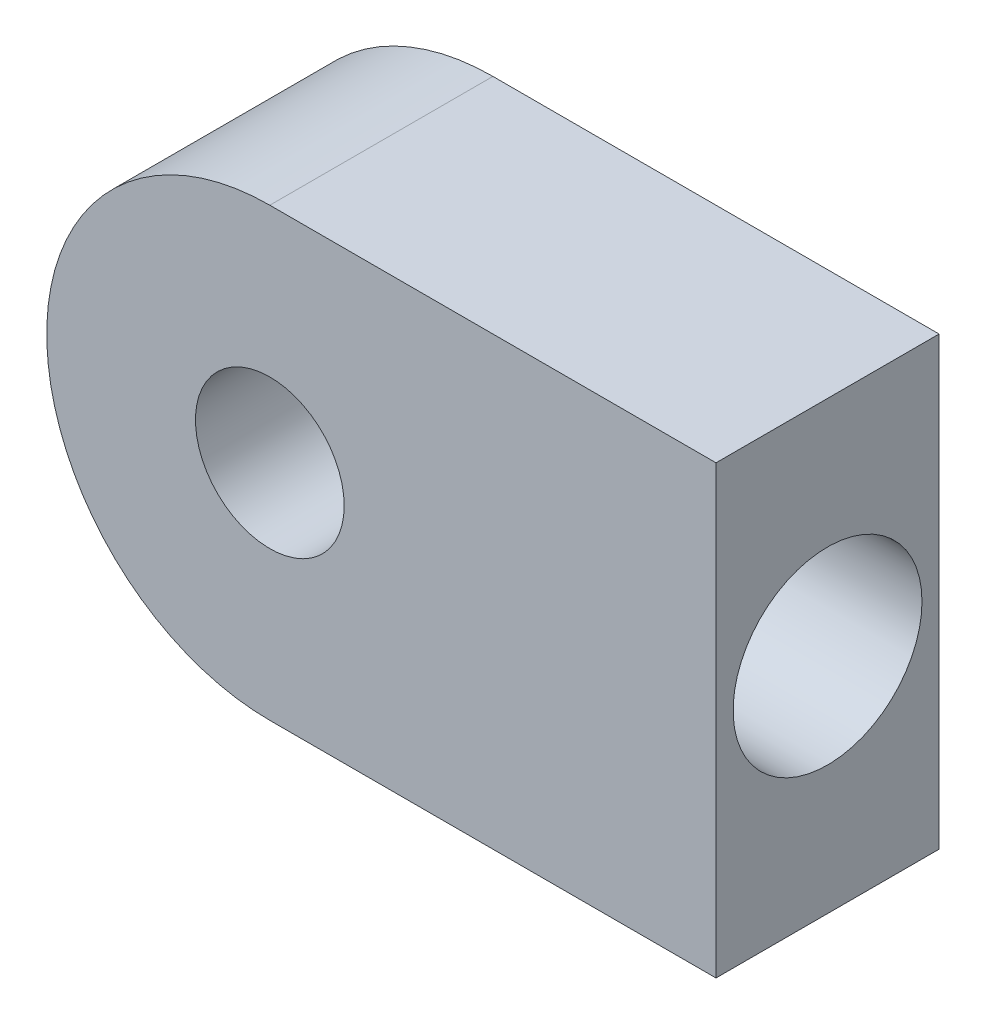
ISO-10303-21;
HEADER;
FILE_DESCRIPTION(('STEP AP214'),'2;1');
FILE_NAME('part.step','',(''),(''),'','','');
FILE_SCHEMA(('AUTOMOTIVE_DESIGN { 1 0 10303 214 1 1 1 1 }'));
ENDSEC;
DATA;
#1=APPLICATION_CONTEXT('core data for automotive mechanical design processes');
#2=APPLICATION_PROTOCOL_DEFINITION('international standard','automotive_design',2000,#1);
#3=PRODUCT_CONTEXT('',#1,'mechanical');
#4=PRODUCT('Part','Part','',(#3));
#5=PRODUCT_RELATED_PRODUCT_CATEGORY('part','',(#4));
#6=PRODUCT_DEFINITION_FORMATION('','',#4);
#7=PRODUCT_DEFINITION_CONTEXT('part definition',#1,'design');
#8=PRODUCT_DEFINITION('design','',#6,#7);
#9=PRODUCT_DEFINITION_SHAPE('','',#8);
#10=(LENGTH_UNIT() NAMED_UNIT(*) SI_UNIT(.MILLI.,.METRE.));
#11=(NAMED_UNIT(*) PLANE_ANGLE_UNIT() SI_UNIT($,.RADIAN.));
#12=(NAMED_UNIT(*) SI_UNIT($,.STERADIAN.) SOLID_ANGLE_UNIT());
#13=UNCERTAINTY_MEASURE_WITH_UNIT(LENGTH_MEASURE(1.E-05),#10,'distance_accuracy_value','');
#14=(GEOMETRIC_REPRESENTATION_CONTEXT(3) GLOBAL_UNCERTAINTY_ASSIGNED_CONTEXT((#13)) GLOBAL_UNIT_ASSIGNED_CONTEXT((#10,
#11,#12)) REPRESENTATION_CONTEXT('',''));
#15=CARTESIAN_POINT('',(0.,0.,0.));
#16=DIRECTION('',(0.,0.,1.));
#17=DIRECTION('',(1.,0.,0.));
#18=AXIS2_PLACEMENT_3D('',#15,#16,#17);
#19=CARTESIAN_POINT('',(0.,0.,7.5));
#20=DIRECTION('',(0.,0.,1.));
#21=DIRECTION('',(1.,0.,0.));
#22=AXIS2_PLACEMENT_3D('',#19,#20,#21);
#23=PLANE('',#22);
#24=CARTESIAN_POINT('',(0.,0.,7.5));
#25=DIRECTION('',(0.,0.,1.));
#26=DIRECTION('',(1.,0.,0.));
#27=AXIS2_PLACEMENT_3D('',#24,#25,#26);
#28=CIRCLE('',#27,15.);
#29=CARTESIAN_POINT('',(0.,15.,7.5));
#30=VERTEX_POINT('',#29);
#31=CARTESIAN_POINT('',(0.,-15.,7.5));
#32=VERTEX_POINT('',#31);
#33=EDGE_CURVE('E85',#30,#32,#28,.T.);
#34=ORIENTED_EDGE('',*,*,#33,.T.);
#35=DIRECTION('',(1.,0.,0.));
#36=VECTOR('',#35,1.);
#37=CARTESIAN_POINT('',(30.,-15.,7.5));
#38=LINE('',#37,#36);
#39=CARTESIAN_POINT('',(30.,-15.,7.5));
#40=VERTEX_POINT('',#39);
#41=EDGE_CURVE('E80',#32,#40,#38,.T.);
#42=ORIENTED_EDGE('',*,*,#41,.T.);
#43=DIRECTION('',(0.,1.,0.));
#44=VECTOR('',#43,1.);
#45=CARTESIAN_POINT('',(30.,15.,7.5));
#46=LINE('',#45,#44);
#47=CARTESIAN_POINT('',(30.,15.,7.5));
#48=VERTEX_POINT('',#47);
#49=EDGE_CURVE('E83',#40,#48,#46,.T.);
#50=ORIENTED_EDGE('',*,*,#49,.T.);
#51=DIRECTION('',(-1.,0.,0.));
#52=VECTOR('',#51,1.);
#53=CARTESIAN_POINT('',(0.,15.,7.5));
#54=LINE('',#53,#52);
#55=EDGE_CURVE('E50',#48,#30,#54,.T.);
#56=ORIENTED_EDGE('',*,*,#55,.T.);
#57=EDGE_LOOP('',(#34,#42,#50,#56));
#58=FACE_BOUND('',#57,.T.);
#59=CARTESIAN_POINT('',(0.,0.,7.5));
#60=DIRECTION('',(0.,0.,1.));
#61=DIRECTION('',(1.,0.,0.));
#62=AXIS2_PLACEMENT_3D('',#59,#60,#61);
#63=CIRCLE('',#62,5.);
#64=CARTESIAN_POINT('',(5.,0.,7.5));
#65=VERTEX_POINT('',#64);
#66=EDGE_CURVE('E100',#65,#65,#63,.T.);
#67=ORIENTED_EDGE('',*,*,#66,.F.);
#68=EDGE_LOOP('',(#67));
#69=FACE_BOUND('',#68,.T.);
#70=ADVANCED_FACE('F33',(#58,#69),#23,.T.);
#71=CARTESIAN_POINT('',(0.,0.,-7.5));
#72=DIRECTION('',(0.,0.,1.));
#73=DIRECTION('',(1.,0.,0.));
#74=AXIS2_PLACEMENT_3D('',#71,#72,#73);
#75=PLANE('',#74);
#76=CARTESIAN_POINT('',(0.,0.,-7.5));
#77=DIRECTION('',(0.,0.,1.));
#78=DIRECTION('',(1.,0.,0.));
#79=AXIS2_PLACEMENT_3D('',#76,#77,#78);
#80=CIRCLE('',#79,15.);
#81=CARTESIAN_POINT('',(0.,15.,-7.5));
#82=VERTEX_POINT('',#81);
#83=CARTESIAN_POINT('',(0.,-15.,-7.5));
#84=VERTEX_POINT('',#83);
#85=EDGE_CURVE('E97',#82,#84,#80,.T.);
#86=ORIENTED_EDGE('',*,*,#85,.F.);
#87=DIRECTION('',(-1.,0.,0.));
#88=VECTOR('',#87,1.);
#89=CARTESIAN_POINT('',(0.,15.,-7.5));
#90=LINE('',#89,#88);
#91=CARTESIAN_POINT('',(30.,15.,-7.5));
#92=VERTEX_POINT('',#91);
#93=EDGE_CURVE('E73',#92,#82,#90,.T.);
#94=ORIENTED_EDGE('',*,*,#93,.F.);
#95=DIRECTION('',(0.,1.,0.));
#96=VECTOR('',#95,1.);
#97=CARTESIAN_POINT('',(30.,15.,-7.5));
#98=LINE('',#97,#96);
#99=CARTESIAN_POINT('',(30.,-15.,-7.5));
#100=VERTEX_POINT('',#99);
#101=EDGE_CURVE('E67',#100,#92,#98,.T.);
#102=ORIENTED_EDGE('',*,*,#101,.F.);
#103=DIRECTION('',(1.,0.,0.));
#104=VECTOR('',#103,1.);
#105=CARTESIAN_POINT('',(30.,-15.,-7.5));
#106=LINE('',#105,#104);
#107=EDGE_CURVE('E89',#84,#100,#106,.T.);
#108=ORIENTED_EDGE('',*,*,#107,.F.);
#109=EDGE_LOOP('',(#86,#94,#102,#108));
#110=FACE_BOUND('',#109,.T.);
#111=CARTESIAN_POINT('',(0.,0.,-7.5));
#112=DIRECTION('',(0.,0.,1.));
#113=DIRECTION('',(1.,0.,0.));
#114=AXIS2_PLACEMENT_3D('',#111,#112,#113);
#115=CIRCLE('',#114,5.);
#116=CARTESIAN_POINT('',(5.,0.,-7.5));
#117=VERTEX_POINT('',#116);
#118=EDGE_CURVE('E112',#117,#117,#115,.T.);
#119=ORIENTED_EDGE('',*,*,#118,.T.);
#120=EDGE_LOOP('',(#119));
#121=FACE_BOUND('',#120,.T.);
#122=ADVANCED_FACE('F108',(#110,#121),#75,.F.);
#123=CARTESIAN_POINT('',(0.,0.,7.5));
#124=DIRECTION('',(0.,0.,-1.));
#125=DIRECTION('',(-1.,0.,0.));
#126=AXIS2_PLACEMENT_3D('',#123,#124,#125);
#127=CYLINDRICAL_SURFACE('',#126,15.);
#128=ORIENTED_EDGE('',*,*,#85,.T.);
#129=DIRECTION('',(0.,0.,-1.));
#130=VECTOR('',#129,1.);
#131=CARTESIAN_POINT('',(0.,-15.,7.5));
#132=LINE('',#131,#130);
#133=EDGE_CURVE('E11',#32,#84,#132,.T.);
#134=ORIENTED_EDGE('',*,*,#133,.F.);
#135=ORIENTED_EDGE('',*,*,#33,.F.);
#136=DIRECTION('',(0.,0.,-1.));
#137=VECTOR('',#136,1.);
#138=CARTESIAN_POINT('',(0.,15.,7.5));
#139=LINE('',#138,#137);
#140=EDGE_CURVE('E93',#30,#82,#139,.T.);
#141=ORIENTED_EDGE('',*,*,#140,.T.);
#142=EDGE_LOOP('',(#128,#134,#135,#141));
#143=FACE_BOUND('',#142,.T.);
#144=ADVANCED_FACE('F35',(#143),#127,.T.);
#145=CARTESIAN_POINT('',(30.,-15.,7.5));
#146=DIRECTION('',(0.,1.,0.));
#147=DIRECTION('',(0.,0.,1.));
#148=AXIS2_PLACEMENT_3D('',#145,#146,#147);
#149=PLANE('',#148);
#150=ORIENTED_EDGE('',*,*,#107,.T.);
#151=DIRECTION('',(0.,0.,-1.));
#152=VECTOR('',#151,1.);
#153=CARTESIAN_POINT('',(30.,-15.,7.5));
#154=LINE('',#153,#152);
#155=EDGE_CURVE('E42',#40,#100,#154,.T.);
#156=ORIENTED_EDGE('',*,*,#155,.F.);
#157=ORIENTED_EDGE('',*,*,#41,.F.);
#158=ORIENTED_EDGE('',*,*,#133,.T.);
#159=EDGE_LOOP('',(#150,#156,#157,#158));
#160=FACE_BOUND('',#159,.T.);
#161=ADVANCED_FACE('F88',(#160),#149,.F.);
#162=CARTESIAN_POINT('',(30.,15.,7.5));
#163=DIRECTION('',(-1.,0.,0.));
#164=DIRECTION('',(0.,0.,1.));
#165=AXIS2_PLACEMENT_3D('',#162,#163,#164);
#166=PLANE('',#165);
#167=CARTESIAN_POINT('',(30.,0.,0.));
#168=DIRECTION('',(1.,0.,0.));
#169=DIRECTION('',(0.,0.,-1.));
#170=AXIS2_PLACEMENT_3D('',#167,#168,#169);
#171=CIRCLE('',#170,6.35);
#172=CARTESIAN_POINT('',(30.,0.,-6.35));
#173=VERTEX_POINT('',#172);
#174=EDGE_CURVE('E118',#173,#173,#171,.T.);
#175=ORIENTED_EDGE('',*,*,#174,.F.);
#176=EDGE_LOOP('',(#175));
#177=FACE_BOUND('',#176,.T.);
#178=ORIENTED_EDGE('',*,*,#101,.T.);
#179=DIRECTION('',(0.,0.,-1.));
#180=VECTOR('',#179,1.);
#181=CARTESIAN_POINT('',(30.,15.,7.5));
#182=LINE('',#181,#180);
#183=EDGE_CURVE('E90',#48,#92,#182,.T.);
#184=ORIENTED_EDGE('',*,*,#183,.F.);
#185=ORIENTED_EDGE('',*,*,#49,.F.);
#186=ORIENTED_EDGE('',*,*,#155,.T.);
#187=EDGE_LOOP('',(#178,#184,#185,#186));
#188=FACE_BOUND('',#187,.T.);
#189=ADVANCED_FACE('F91',(#177,#188),#166,.F.);
#190=CARTESIAN_POINT('',(0.,15.,7.5));
#191=DIRECTION('',(0.,-1.,0.));
#192=DIRECTION('',(0.,0.,-1.));
#193=AXIS2_PLACEMENT_3D('',#190,#191,#192);
#194=PLANE('',#193);
#195=ORIENTED_EDGE('',*,*,#93,.T.);
#196=ORIENTED_EDGE('',*,*,#140,.F.);
#197=ORIENTED_EDGE('',*,*,#55,.F.);
#198=ORIENTED_EDGE('',*,*,#183,.T.);
#199=EDGE_LOOP('',(#195,#196,#197,#198));
#200=FACE_BOUND('',#199,.T.);
#201=ADVANCED_FACE('F105',(#200),#194,.F.);
#202=CARTESIAN_POINT('',(0.,0.,7.5));
#203=DIRECTION('',(0.,0.,-1.));
#204=DIRECTION('',(-1.,0.,0.));
#205=AXIS2_PLACEMENT_3D('',#202,#203,#204);
#206=CYLINDRICAL_SURFACE('',#205,5.);
#207=ORIENTED_EDGE('',*,*,#66,.T.);
#208=EDGE_LOOP('',(#207));
#209=FACE_BOUND('',#208,.T.);
#210=ORIENTED_EDGE('',*,*,#118,.F.);
#211=EDGE_LOOP('',(#210));
#212=FACE_BOUND('',#211,.T.);
#213=ADVANCED_FACE('F129',(#209,#212),#206,.F.);
#214=CARTESIAN_POINT('',(10.,0.,0.));
#215=DIRECTION('',(1.,0.,0.));
#216=DIRECTION('',(0.,0.,-1.));
#217=AXIS2_PLACEMENT_3D('',#214,#215,#216);
#218=CYLINDRICAL_SURFACE('',#217,6.35);
#219=CARTESIAN_POINT('',(10.,0.,0.));
#220=DIRECTION('',(1.,0.,0.));
#221=DIRECTION('',(0.,0.,-1.));
#222=AXIS2_PLACEMENT_3D('',#219,#220,#221);
#223=CIRCLE('',#222,6.35);
#224=CARTESIAN_POINT('',(10.,0.,-6.35));
#225=VERTEX_POINT('',#224);
#226=EDGE_CURVE('E115',#225,#225,#223,.T.);
#227=ORIENTED_EDGE('',*,*,#226,.F.);
#228=EDGE_LOOP('',(#227));
#229=FACE_BOUND('',#228,.T.);
#230=ORIENTED_EDGE('',*,*,#174,.T.);
#231=EDGE_LOOP('',(#230));
#232=FACE_BOUND('',#231,.T.);
#233=ADVANCED_FACE('F126',(#229,#232),#218,.F.);
#234=CARTESIAN_POINT('',(10.,0.,0.));
#235=DIRECTION('',(1.,0.,0.));
#236=DIRECTION('',(0.,0.,-1.));
#237=AXIS2_PLACEMENT_3D('',#234,#235,#236);
#238=PLANE('',#237);
#239=ORIENTED_EDGE('',*,*,#226,.T.);
#240=EDGE_LOOP('',(#239));
#241=FACE_BOUND('',#240,.T.);
#242=ADVANCED_FACE('F124',(#241),#238,.T.);
#243=CLOSED_SHELL('',(#70,#122,#144,#161,#189,#201,#213,#233,#242));
#244=MANIFOLD_SOLID_BREP('B2',#243);
#245=ADVANCED_BREP_SHAPE_REPRESENTATION('',(#18,#244),#14);
#246=SHAPE_DEFINITION_REPRESENTATION(#9,#245);
ENDSEC;
END-ISO-10303-21;
